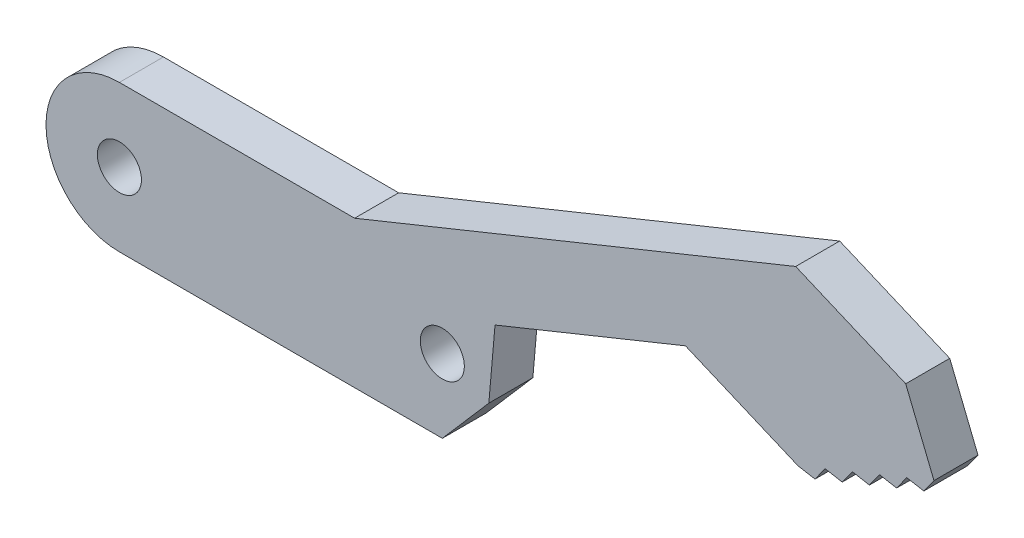
ISO-10303-21;
HEADER;
FILE_DESCRIPTION(('STEP AP214'),'2;1');
FILE_NAME('part.step','',(''),(''),'','','');
FILE_SCHEMA(('AUTOMOTIVE_DESIGN { 1 0 10303 214 1 1 1 1 }'));
ENDSEC;
DATA;
#1=APPLICATION_CONTEXT('core data for automotive mechanical design processes');
#2=APPLICATION_PROTOCOL_DEFINITION('international standard','automotive_design',2000,#1);
#3=PRODUCT_CONTEXT('',#1,'mechanical');
#4=PRODUCT('Part','Part','',(#3));
#5=PRODUCT_RELATED_PRODUCT_CATEGORY('part','',(#4));
#6=PRODUCT_DEFINITION_FORMATION('','',#4);
#7=PRODUCT_DEFINITION_CONTEXT('part definition',#1,'design');
#8=PRODUCT_DEFINITION('design','',#6,#7);
#9=PRODUCT_DEFINITION_SHAPE('','',#8);
#10=(LENGTH_UNIT() NAMED_UNIT(*) SI_UNIT(.MILLI.,.METRE.));
#11=(NAMED_UNIT(*) PLANE_ANGLE_UNIT() SI_UNIT($,.RADIAN.));
#12=(NAMED_UNIT(*) SI_UNIT($,.STERADIAN.) SOLID_ANGLE_UNIT());
#13=UNCERTAINTY_MEASURE_WITH_UNIT(LENGTH_MEASURE(1.E-05),#10,'distance_accuracy_value','');
#14=(GEOMETRIC_REPRESENTATION_CONTEXT(3) GLOBAL_UNCERTAINTY_ASSIGNED_CONTEXT((#13)) GLOBAL_UNIT_ASSIGNED_CONTEXT((#10,
#11,#12)) REPRESENTATION_CONTEXT('',''));
#15=CARTESIAN_POINT('',(0.,0.,0.));
#16=DIRECTION('',(0.,0.,1.));
#17=DIRECTION('',(1.,0.,0.));
#18=AXIS2_PLACEMENT_3D('',#15,#16,#17);
#19=CARTESIAN_POINT('',(-11.,0.,3.));
#20=DIRECTION('',(0.,0.,1.));
#21=DIRECTION('',(1.,0.,0.));
#22=AXIS2_PLACEMENT_3D('',#19,#20,#21);
#23=PLANE('',#22);
#24=CARTESIAN_POINT('',(-11.,0.,3.));
#25=DIRECTION('',(0.,0.,1.));
#26=DIRECTION('',(1.,0.,0.));
#27=AXIS2_PLACEMENT_3D('',#24,#25,#26);
#28=CIRCLE('',#27,1.5);
#29=CARTESIAN_POINT('',(-9.5,0.,3.));
#30=VERTEX_POINT('',#29);
#31=EDGE_CURVE('E502',#30,#30,#28,.T.);
#32=ORIENTED_EDGE('',*,*,#31,.F.);
#33=EDGE_LOOP('',(#32));
#34=FACE_BOUND('',#33,.T.);
#35=CARTESIAN_POINT('',(11.,0.,3.));
#36=DIRECTION('',(0.,0.,1.));
#37=DIRECTION('',(1.,0.,0.));
#38=AXIS2_PLACEMENT_3D('',#35,#36,#37);
#39=CIRCLE('',#38,1.5);
#40=CARTESIAN_POINT('',(12.5,0.,3.));
#41=VERTEX_POINT('',#40);
#42=EDGE_CURVE('E496',#41,#41,#39,.T.);
#43=ORIENTED_EDGE('',*,*,#42,.F.);
#44=EDGE_LOOP('',(#43));
#45=FACE_BOUND('',#44,.T.);
#46=DIRECTION('',(0.583953193038435,0.811787329502141,0.));
#47=VECTOR('',#46,1.);
#48=CARTESIAN_POINT('',(20.3180880668314,-22.5284343101303,3.));
#49=LINE('',#48,#47);
#50=CARTESIAN_POINT('',(41.9489676857093,7.54191072767047,3.));
#51=VERTEX_POINT('',#50);
#52=CARTESIAN_POINT('',(42.6391450253805,8.50136642743177,3.));
#53=VERTEX_POINT('',#52);
#54=EDGE_CURVE('E380',#51,#53,#49,.T.);
#55=ORIENTED_EDGE('',*,*,#54,.T.);
#56=DIRECTION('',(0.98434691523672,-0.17624173871122,0.));
#57=VECTOR('',#56,1.);
#58=CARTESIAN_POINT('',(-7.85906379305354,17.5427846370097,3.));
#59=LINE('',#58,#57);
#60=CARTESIAN_POINT('',(43.8025498040009,8.29306539266934,3.));
#61=VERTEX_POINT('',#60);
#62=EDGE_CURVE('E373',#53,#61,#59,.T.);
#63=ORIENTED_EDGE('',*,*,#62,.T.);
#64=DIRECTION('',(0.583953193038437,0.811787329502139,0.));
#65=VECTOR('',#64,1.);
#66=CARTESIAN_POINT('',(21.1835144979997,-23.1509723930179,3.));
#67=LINE('',#66,#65);
#68=CARTESIAN_POINT('',(44.4927271436721,9.25252109243066,3.));
#69=VERTEX_POINT('',#68);
#70=EDGE_CURVE('E459',#61,#69,#67,.T.);
#71=ORIENTED_EDGE('',*,*,#70,.T.);
#72=DIRECTION('',(-0.375577332499434,0.926791059145808,0.));
#73=VECTOR('',#72,1.);
#74=CARTESIAN_POINT('',(44.7293408631468,8.66864272516878,3.));
#75=LINE('',#74,#73);
#76=CARTESIAN_POINT('',(42.5675474157339,14.0031788257606,3.));
#77=VERTEX_POINT('',#76);
#78=EDGE_CURVE('E470',#69,#77,#75,.T.);
#79=ORIENTED_EDGE('',*,*,#78,.T.);
#80=DIRECTION('',(0.920913521335368,-0.389766963994759,0.));
#81=VECTOR('',#80,1.);
#82=CARTESIAN_POINT('',(35.0712178677293,17.1759214789395,3.));
#83=LINE('',#82,#81);
#84=CARTESIAN_POINT('',(35.0712178677293,17.1759214789395,3.));
#85=VERTEX_POINT('',#84);
#86=EDGE_CURVE('E462',#85,#77,#83,.T.);
#87=ORIENTED_EDGE('',*,*,#86,.F.);
#88=DIRECTION('',(-0.926791059145809,-0.375577332499434,0.));
#89=VECTOR('',#88,1.);
#90=CARTESIAN_POINT('',(40.4057539683211,19.3377149263524,3.));
#91=LINE('',#90,#89);
#92=CARTESIAN_POINT('',(5.0253812661299,5.,3.));
#93=VERTEX_POINT('',#92);
#94=EDGE_CURVE('E240',#85,#93,#91,.T.);
#95=ORIENTED_EDGE('',*,*,#94,.T.);
#96=DIRECTION('',(-1.,0.,0.));
#97=VECTOR('',#96,1.);
#98=CARTESIAN_POINT('',(11.,5.,3.));
#99=LINE('',#98,#97);
#100=CARTESIAN_POINT('',(-11.,5.,3.));
#101=VERTEX_POINT('',#100);
#102=EDGE_CURVE('E513',#93,#101,#99,.T.);
#103=ORIENTED_EDGE('',*,*,#102,.T.);
#104=CARTESIAN_POINT('',(-11.,0.,3.));
#105=DIRECTION('',(0.,0.,1.));
#106=DIRECTION('',(1.,0.,0.));
#107=AXIS2_PLACEMENT_3D('',#104,#105,#106);
#108=CIRCLE('',#107,5.);
#109=CARTESIAN_POINT('',(-11.,-5.,3.));
#110=VERTEX_POINT('',#109);
#111=EDGE_CURVE('E508',#101,#110,#108,.T.);
#112=ORIENTED_EDGE('',*,*,#111,.T.);
#113=DIRECTION('',(1.,0.,0.));
#114=VECTOR('',#113,1.);
#115=CARTESIAN_POINT('',(11.,-5.,3.));
#116=LINE('',#115,#114);
#117=CARTESIAN_POINT('',(11.,-5.,3.));
#118=VERTEX_POINT('',#117);
#119=EDGE_CURVE('E511',#110,#118,#116,.T.);
#120=ORIENTED_EDGE('',*,*,#119,.T.);
#121=DIRECTION('',(-0.654532528371202,-0.756033841374844,0.));
#122=VECTOR('',#121,1.);
#123=CARTESIAN_POINT('',(4.04916143333439,-13.0287364715239,3.));
#124=LINE('',#123,#122);
#125=CARTESIAN_POINT('',(14.1679374373166,-1.34079620774576,3.));
#126=VERTEX_POINT('',#125);
#127=EDGE_CURVE('E396',#126,#118,#124,.T.);
#128=ORIENTED_EDGE('',*,*,#127,.F.);
#129=DIRECTION('',(-0.0870824867375038,-0.996201104448099,0.));
#130=VECTOR('',#129,1.);
#131=CARTESIAN_POINT('',(14.0933962293825,-2.19352832935749,3.));
#132=LINE('',#131,#130);
#133=CARTESIAN_POINT('',(14.5894166731261,3.48081713778304,3.));
#134=VERTEX_POINT('',#133);
#135=EDGE_CURVE('E394',#134,#126,#132,.T.);
#136=ORIENTED_EDGE('',*,*,#135,.F.);
#137=DIRECTION('',(-0.926791059145808,-0.375577332499435,0.));
#138=VECTOR('',#137,1.);
#139=CARTESIAN_POINT('',(27.5644915011674,8.73889979277513,3.));
#140=LINE('',#139,#138);
#141=CARTESIAN_POINT('',(27.5644915011674,8.73889979277513,3.));
#142=VERTEX_POINT('',#141);
#143=EDGE_CURVE('E485',#142,#134,#140,.T.);
#144=ORIENTED_EDGE('',*,*,#143,.F.);
#145=DIRECTION('',(-0.920913521335371,0.389766963994754,0.));
#146=VECTOR('',#145,1.);
#147=CARTESIAN_POINT('',(35.224816552214,5.4967477674363,3.));
#148=LINE('',#147,#146);
#149=CARTESIAN_POINT('',(35.224816552214,5.4967477674363,3.));
#150=VERTEX_POINT('',#149);
#151=EDGE_CURVE('E475',#150,#142,#148,.T.);
#152=ORIENTED_EDGE('',*,*,#151,.F.);
#153=DIRECTION('',(0.98434691523672,-0.176241738711218,0.));
#154=VECTOR('',#153,1.);
#155=CARTESIAN_POINT('',(-8.61061165990349,13.3452328550301,3.));
#156=LINE('',#155,#154);
#157=CARTESIAN_POINT('',(36.3882213308345,5.28844673267387,3.));
#158=VERTEX_POINT('',#157);
#159=EDGE_CURVE('E405',#150,#158,#156,.T.);
#160=ORIENTED_EDGE('',*,*,#159,.T.);
#161=DIRECTION('',(0.583953193038435,0.81178732950214,0.));
#162=VECTOR('',#161,1.);
#163=CARTESIAN_POINT('',(17.7218087733259,-20.6608200614676,3.));
#164=LINE('',#163,#162);
#165=CARTESIAN_POINT('',(37.0783986705056,6.24790243243516,3.));
#166=VERTEX_POINT('',#165);
#167=EDGE_CURVE('E427',#158,#166,#164,.T.);
#168=ORIENTED_EDGE('',*,*,#167,.T.);
#169=DIRECTION('',(0.984346915236721,-0.176241738711215,0.));
#170=VECTOR('',#169,1.);
#171=CARTESIAN_POINT('',(-8.42272469319109,14.3946208005248,3.));
#172=LINE('',#171,#170);
#173=CARTESIAN_POINT('',(38.2418034491261,6.03960139767273,3.));
#174=VERTEX_POINT('',#173);
#175=EDGE_CURVE('E450',#166,#174,#172,.T.);
#176=ORIENTED_EDGE('',*,*,#175,.T.);
#177=DIRECTION('',(0.583953193038435,0.81178732950214,0.));
#178=VECTOR('',#177,1.);
#179=CARTESIAN_POINT('',(18.5872352044944,-21.2833581443551,3.));
#180=LINE('',#179,#178);
#181=CARTESIAN_POINT('',(38.9319807887972,6.99905709743402,3.));
#182=VERTEX_POINT('',#181);
#183=EDGE_CURVE('E421',#174,#182,#180,.T.);
#184=ORIENTED_EDGE('',*,*,#183,.T.);
#185=DIRECTION('',(0.984346915236721,-0.176241738711213,0.));
#186=VECTOR('',#185,1.);
#187=CARTESIAN_POINT('',(-8.23483772647869,15.4440087460196,3.));
#188=LINE('',#187,#186);
#189=CARTESIAN_POINT('',(40.0953855674177,6.7907560626716,3.));
#190=VERTEX_POINT('',#189);
#191=EDGE_CURVE('E417',#182,#190,#188,.T.);
#192=ORIENTED_EDGE('',*,*,#191,.T.);
#193=DIRECTION('',(0.583953193038434,0.811787329502141,0.));
#194=VECTOR('',#193,1.);
#195=CARTESIAN_POINT('',(19.4526616356629,-21.9058962272427,3.));
#196=LINE('',#195,#194);
#197=CARTESIAN_POINT('',(40.7855629070889,7.75021176243289,3.));
#198=VERTEX_POINT('',#197);
#199=EDGE_CURVE('E453',#190,#198,#196,.T.);
#200=ORIENTED_EDGE('',*,*,#199,.T.);
#201=DIRECTION('',(0.984346915236721,-0.176241738711217,0.));
#202=VECTOR('',#201,1.);
#203=CARTESIAN_POINT('',(-8.04695075976612,16.4933966915146,3.));
#204=LINE('',#203,#202);
#205=EDGE_CURVE('E456',#198,#51,#204,.T.);
#206=ORIENTED_EDGE('',*,*,#205,.T.);
#207=EDGE_LOOP('',(#55,#63,#71,#79,#87,#95,#103,#112,#120,#128,#136,#144,#152,#160,#168,#176,
#184,#192,#200,#206));
#208=FACE_BOUND('',#207,.T.);
#209=ADVANCED_FACE('F215',(#34,#45,#208),#23,.T.);
#210=CARTESIAN_POINT('',(-11.,0.,0.));
#211=DIRECTION('',(0.,0.,1.));
#212=DIRECTION('',(1.,0.,0.));
#213=AXIS2_PLACEMENT_3D('',#210,#211,#212);
#214=PLANE('',#213);
#215=CARTESIAN_POINT('',(-11.,0.,0.));
#216=DIRECTION('',(0.,0.,1.));
#217=DIRECTION('',(1.,0.,0.));
#218=AXIS2_PLACEMENT_3D('',#215,#216,#217);
#219=CIRCLE('',#218,1.5);
#220=CARTESIAN_POINT('',(-9.5,0.,0.));
#221=VERTEX_POINT('',#220);
#222=EDGE_CURVE('E499',#221,#221,#219,.T.);
#223=ORIENTED_EDGE('',*,*,#222,.T.);
#224=EDGE_LOOP('',(#223));
#225=FACE_BOUND('',#224,.T.);
#226=CARTESIAN_POINT('',(11.,0.,0.));
#227=DIRECTION('',(0.,0.,1.));
#228=DIRECTION('',(1.,0.,0.));
#229=AXIS2_PLACEMENT_3D('',#226,#227,#228);
#230=CIRCLE('',#229,1.5);
#231=CARTESIAN_POINT('',(12.5,0.,0.));
#232=VERTEX_POINT('',#231);
#233=EDGE_CURVE('E490',#232,#232,#230,.T.);
#234=ORIENTED_EDGE('',*,*,#233,.T.);
#235=EDGE_LOOP('',(#234));
#236=FACE_BOUND('',#235,.T.);
#237=DIRECTION('',(0.98434691523672,-0.17624173871122,0.));
#238=VECTOR('',#237,1.);
#239=CARTESIAN_POINT('',(2.79926355184296,15.6344715068098,0.));
#240=LINE('',#239,#238);
#241=CARTESIAN_POINT('',(42.6391450253805,8.50136642743177,0.));
#242=VERTEX_POINT('',#241);
#243=CARTESIAN_POINT('',(43.8025498040009,8.29306539266934,0.));
#244=VERTEX_POINT('',#243);
#245=EDGE_CURVE('E367',#242,#244,#240,.T.);
#246=ORIENTED_EDGE('',*,*,#245,.F.);
#247=DIRECTION('',(0.583953193038435,0.81178732950214,0.));
#248=VECTOR('',#247,1.);
#249=CARTESIAN_POINT('',(24.069102715089,-17.3139304756902,0.));
#250=LINE('',#249,#248);
#251=CARTESIAN_POINT('',(41.9489676857093,7.54191072767047,0.));
#252=VERTEX_POINT('',#251);
#253=EDGE_CURVE('E356',#252,#242,#250,.T.);
#254=ORIENTED_EDGE('',*,*,#253,.F.);
#255=DIRECTION('',(0.984346915236721,-0.176241738711217,0.));
#256=VECTOR('',#255,1.);
#257=CARTESIAN_POINT('',(2.6113765851304,14.5850835613148,0.));
#258=LINE('',#257,#256);
#259=CARTESIAN_POINT('',(40.7855629070889,7.75021176243289,0.));
#260=VERTEX_POINT('',#259);
#261=EDGE_CURVE('E430',#260,#252,#258,.T.);
#262=ORIENTED_EDGE('',*,*,#261,.F.);
#263=DIRECTION('',(0.583953193038434,0.811787329502141,0.));
#264=VECTOR('',#263,1.);
#265=CARTESIAN_POINT('',(23.2036762839205,-16.6913923928026,0.));
#266=LINE('',#265,#264);
#267=CARTESIAN_POINT('',(40.0953855674177,6.7907560626716,0.));
#268=VERTEX_POINT('',#267);
#269=EDGE_CURVE('E435',#268,#260,#266,.T.);
#270=ORIENTED_EDGE('',*,*,#269,.F.);
#271=DIRECTION('',(0.984346915236721,-0.176241738711213,0.));
#272=VECTOR('',#271,1.);
#273=CARTESIAN_POINT('',(2.42348961841785,13.5356956158198,0.));
#274=LINE('',#273,#272);
#275=CARTESIAN_POINT('',(38.9319807887972,6.99905709743402,0.));
#276=VERTEX_POINT('',#275);
#277=EDGE_CURVE('E415',#276,#268,#274,.T.);
#278=ORIENTED_EDGE('',*,*,#277,.F.);
#279=DIRECTION('',(0.583953193038435,0.81178732950214,0.));
#280=VECTOR('',#279,1.);
#281=CARTESIAN_POINT('',(22.338249852752,-16.068854309915,0.));
#282=LINE('',#281,#280);
#283=CARTESIAN_POINT('',(38.2418034491261,6.03960139767273,0.));
#284=VERTEX_POINT('',#283);
#285=EDGE_CURVE('E413',#284,#276,#282,.T.);
#286=ORIENTED_EDGE('',*,*,#285,.F.);
#287=DIRECTION('',(0.984346915236721,-0.176241738711215,0.));
#288=VECTOR('',#287,1.);
#289=CARTESIAN_POINT('',(2.23560265170544,12.4863076703251,0.));
#290=LINE('',#289,#288);
#291=CARTESIAN_POINT('',(37.0783986705056,6.24790243243516,0.));
#292=VERTEX_POINT('',#291);
#293=EDGE_CURVE('E436',#292,#284,#290,.T.);
#294=ORIENTED_EDGE('',*,*,#293,.F.);
#295=DIRECTION('',(0.583953193038435,0.81178732950214,0.));
#296=VECTOR('',#295,1.);
#297=CARTESIAN_POINT('',(21.4728234215835,-15.4463162270274,0.));
#298=LINE('',#297,#296);
#299=CARTESIAN_POINT('',(36.3882213308345,5.28844673267387,0.));
#300=VERTEX_POINT('',#299);
#301=EDGE_CURVE('E442',#300,#292,#298,.T.);
#302=ORIENTED_EDGE('',*,*,#301,.F.);
#303=DIRECTION('',(0.98434691523672,-0.176241738711218,0.));
#304=VECTOR('',#303,1.);
#305=CARTESIAN_POINT('',(2.04771568499302,11.4369197248303,0.));
#306=LINE('',#305,#304);
#307=CARTESIAN_POINT('',(35.224816552214,5.4967477674363,0.));
#308=VERTEX_POINT('',#307);
#309=EDGE_CURVE('E403',#308,#300,#306,.T.);
#310=ORIENTED_EDGE('',*,*,#309,.F.);
#311=DIRECTION('',(-0.920913521335371,0.389766963994754,0.));
#312=VECTOR('',#311,1.);
#313=CARTESIAN_POINT('',(35.224816552214,5.4967477674363,0.));
#314=LINE('',#313,#312);
#315=CARTESIAN_POINT('',(27.5644915011674,8.73889979277513,0.));
#316=VERTEX_POINT('',#315);
#317=EDGE_CURVE('E480',#308,#316,#314,.T.);
#318=ORIENTED_EDGE('',*,*,#317,.T.);
#319=DIRECTION('',(-0.926791059145808,-0.375577332499435,0.));
#320=VECTOR('',#319,1.);
#321=CARTESIAN_POINT('',(27.5644915011674,8.73889979277513,0.));
#322=LINE('',#321,#320);
#323=CARTESIAN_POINT('',(14.5894166731261,3.48081713778304,0.));
#324=VERTEX_POINT('',#323);
#325=EDGE_CURVE('E477',#316,#324,#322,.T.);
#326=ORIENTED_EDGE('',*,*,#325,.T.);
#327=DIRECTION('',(-0.0870824867375038,-0.996201104448099,0.));
#328=VECTOR('',#327,1.);
#329=CARTESIAN_POINT('',(14.5894166731261,3.48081713778304,0.));
#330=LINE('',#329,#328);
#331=CARTESIAN_POINT('',(14.1679374373166,-1.34079620774576,0.));
#332=VERTEX_POINT('',#331);
#333=EDGE_CURVE('E388',#324,#332,#330,.T.);
#334=ORIENTED_EDGE('',*,*,#333,.T.);
#335=DIRECTION('',(-0.654532528371201,-0.756033841374844,0.));
#336=VECTOR('',#335,1.);
#337=CARTESIAN_POINT('',(14.1679374373166,-1.34079620774576,0.));
#338=LINE('',#337,#336);
#339=CARTESIAN_POINT('',(11.,-5.,0.));
#340=VERTEX_POINT('',#339);
#341=EDGE_CURVE('E384',#332,#340,#338,.T.);
#342=ORIENTED_EDGE('',*,*,#341,.T.);
#343=DIRECTION('',(1.,0.,0.));
#344=VECTOR('',#343,1.);
#345=CARTESIAN_POINT('',(11.,-5.,0.));
#346=LINE('',#345,#344);
#347=CARTESIAN_POINT('',(-11.,-5.,0.));
#348=VERTEX_POINT('',#347);
#349=EDGE_CURVE('E518',#348,#340,#346,.T.);
#350=ORIENTED_EDGE('',*,*,#349,.F.);
#351=CARTESIAN_POINT('',(-11.,0.,0.));
#352=DIRECTION('',(0.,0.,1.));
#353=DIRECTION('',(1.,0.,0.));
#354=AXIS2_PLACEMENT_3D('',#351,#352,#353);
#355=CIRCLE('',#354,5.);
#356=CARTESIAN_POINT('',(-11.,5.,0.));
#357=VERTEX_POINT('',#356);
#358=EDGE_CURVE('E505',#357,#348,#355,.T.);
#359=ORIENTED_EDGE('',*,*,#358,.F.);
#360=DIRECTION('',(-1.,0.,0.));
#361=VECTOR('',#360,1.);
#362=CARTESIAN_POINT('',(11.,5.,0.));
#363=LINE('',#362,#361);
#364=CARTESIAN_POINT('',(5.0253812661299,5.,0.));
#365=VERTEX_POINT('',#364);
#366=EDGE_CURVE('E512',#365,#357,#363,.T.);
#367=ORIENTED_EDGE('',*,*,#366,.F.);
#368=DIRECTION('',(-0.926791059145809,-0.375577332499434,0.));
#369=VECTOR('',#368,1.);
#370=CARTESIAN_POINT('',(40.4057539683211,19.3377149263524,0.));
#371=LINE('',#370,#369);
#372=CARTESIAN_POINT('',(35.0712178677293,17.1759214789395,0.));
#373=VERTEX_POINT('',#372);
#374=EDGE_CURVE('E474',#373,#365,#371,.T.);
#375=ORIENTED_EDGE('',*,*,#374,.F.);
#376=DIRECTION('',(0.920913521335368,-0.389766963994759,0.));
#377=VECTOR('',#376,1.);
#378=CARTESIAN_POINT('',(35.0712178677293,17.1759214789395,0.));
#379=LINE('',#378,#377);
#380=CARTESIAN_POINT('',(42.5675474157339,14.0031788257606,0.));
#381=VERTEX_POINT('',#380);
#382=EDGE_CURVE('E232',#373,#381,#379,.T.);
#383=ORIENTED_EDGE('',*,*,#382,.T.);
#384=DIRECTION('',(-0.375577332499434,0.926791059145808,0.));
#385=VECTOR('',#384,1.);
#386=CARTESIAN_POINT('',(44.7293408631468,8.66864272516878,0.));
#387=LINE('',#386,#385);
#388=CARTESIAN_POINT('',(44.4927271436721,9.25252109243066,0.));
#389=VERTEX_POINT('',#388);
#390=EDGE_CURVE('E472',#389,#381,#387,.T.);
#391=ORIENTED_EDGE('',*,*,#390,.F.);
#392=DIRECTION('',(0.583953193038437,0.811787329502139,0.));
#393=VECTOR('',#392,1.);
#394=CARTESIAN_POINT('',(24.9345291462574,-17.9364685585778,0.));
#395=LINE('',#394,#393);
#396=EDGE_CURVE('E378',#244,#389,#395,.T.);
#397=ORIENTED_EDGE('',*,*,#396,.F.);
#398=EDGE_LOOP('',(#246,#254,#262,#270,#278,#286,#294,#302,#310,#318,#326,#334,#342,#350,#359,
#367,#375,#383,#391,#397));
#399=FACE_BOUND('',#398,.T.);
#400=ADVANCED_FACE('F376',(#225,#236,#399),#214,.F.);
#401=CARTESIAN_POINT('',(44.7293408631468,8.66864272516878,0.));
#402=DIRECTION('',(0.926791059145808,0.375577332499434,0.));
#403=DIRECTION('',(-0.375577332499434,0.926791059145809,0.));
#404=AXIS2_PLACEMENT_3D('',#401,#402,#403);
#405=PLANE('',#404);
#406=ORIENTED_EDGE('',*,*,#78,.F.);
#407=DIRECTION('',(0.,0.,1.));
#408=VECTOR('',#407,1.);
#409=CARTESIAN_POINT('',(44.4927271436721,9.25252109243066,0.));
#410=LINE('',#409,#408);
#411=EDGE_CURVE('E428',#389,#69,#410,.T.);
#412=ORIENTED_EDGE('',*,*,#411,.F.);
#413=ORIENTED_EDGE('',*,*,#390,.T.);
#414=DIRECTION('',(0.,0.,1.));
#415=VECTOR('',#414,1.);
#416=CARTESIAN_POINT('',(42.5675474157339,14.0031788257606,0.));
#417=LINE('',#416,#415);
#418=EDGE_CURVE('E467',#381,#77,#417,.T.);
#419=ORIENTED_EDGE('',*,*,#418,.T.);
#420=EDGE_LOOP('',(#406,#412,#413,#419));
#421=FACE_BOUND('',#420,.T.);
#422=ADVANCED_FACE('F580',(#421),#405,.T.);
#423=CARTESIAN_POINT('',(-11.,0.,3.));
#424=DIRECTION('',(0.,0.,-1.));
#425=DIRECTION('',(-1.,0.,0.));
#426=AXIS2_PLACEMENT_3D('',#423,#424,#425);
#427=CYLINDRICAL_SURFACE('',#426,5.);
#428=ORIENTED_EDGE('',*,*,#358,.T.);
#429=DIRECTION('',(0.,0.,-1.));
#430=VECTOR('',#429,1.);
#431=CARTESIAN_POINT('',(-11.,-5.,3.));
#432=LINE('',#431,#430);
#433=EDGE_CURVE('E12',#110,#348,#432,.T.);
#434=ORIENTED_EDGE('',*,*,#433,.F.);
#435=ORIENTED_EDGE('',*,*,#111,.F.);
#436=DIRECTION('',(0.,0.,-1.));
#437=VECTOR('',#436,1.);
#438=CARTESIAN_POINT('',(-11.,5.,3.));
#439=LINE('',#438,#437);
#440=EDGE_CURVE('E515',#101,#357,#439,.T.);
#441=ORIENTED_EDGE('',*,*,#440,.T.);
#442=EDGE_LOOP('',(#428,#434,#435,#441));
#443=FACE_BOUND('',#442,.T.);
#444=ADVANCED_FACE('F217',(#443),#427,.T.);
#445=CARTESIAN_POINT('',(11.,-5.,3.));
#446=DIRECTION('',(0.,1.,0.));
#447=DIRECTION('',(-1.,0.,0.));
#448=AXIS2_PLACEMENT_3D('',#445,#446,#447);
#449=PLANE('',#448);
#450=ORIENTED_EDGE('',*,*,#349,.T.);
#451=DIRECTION('',(0.,0.,-1.));
#452=VECTOR('',#451,1.);
#453=CARTESIAN_POINT('',(11.,-5.,3.));
#454=LINE('',#453,#452);
#455=EDGE_CURVE('E224',#118,#340,#454,.T.);
#456=ORIENTED_EDGE('',*,*,#455,.F.);
#457=ORIENTED_EDGE('',*,*,#119,.F.);
#458=ORIENTED_EDGE('',*,*,#433,.T.);
#459=EDGE_LOOP('',(#450,#456,#457,#458));
#460=FACE_BOUND('',#459,.T.);
#461=ADVANCED_FACE('F596',(#460),#449,.F.);
#462=CARTESIAN_POINT('',(11.,5.,3.));
#463=DIRECTION('',(0.,-1.,0.));
#464=DIRECTION('',(1.,0.,0.));
#465=AXIS2_PLACEMENT_3D('',#462,#463,#464);
#466=PLANE('',#465);
#467=ORIENTED_EDGE('',*,*,#102,.F.);
#468=DIRECTION('',(0.,0.,1.));
#469=VECTOR('',#468,1.);
#470=CARTESIAN_POINT('',(5.0253812661299,5.,0.));
#471=LINE('',#470,#469);
#472=EDGE_CURVE('E482',#365,#93,#471,.T.);
#473=ORIENTED_EDGE('',*,*,#472,.F.);
#474=ORIENTED_EDGE('',*,*,#366,.T.);
#475=ORIENTED_EDGE('',*,*,#440,.F.);
#476=EDGE_LOOP('',(#467,#473,#474,#475));
#477=FACE_BOUND('',#476,.T.);
#478=ADVANCED_FACE('F589',(#477),#466,.F.);
#479=CARTESIAN_POINT('',(-11.,0.,3.));
#480=DIRECTION('',(0.,0.,-1.));
#481=DIRECTION('',(-1.,0.,0.));
#482=AXIS2_PLACEMENT_3D('',#479,#480,#481);
#483=CYLINDRICAL_SURFACE('',#482,1.5);
#484=ORIENTED_EDGE('',*,*,#31,.T.);
#485=EDGE_LOOP('',(#484));
#486=FACE_BOUND('',#485,.T.);
#487=ORIENTED_EDGE('',*,*,#222,.F.);
#488=EDGE_LOOP('',(#487));
#489=FACE_BOUND('',#488,.T.);
#490=ADVANCED_FACE('F623',(#486,#489),#483,.F.);
#491=CARTESIAN_POINT('',(11.,0.,3.));
#492=DIRECTION('',(0.,0.,-1.));
#493=DIRECTION('',(-1.,0.,0.));
#494=AXIS2_PLACEMENT_3D('',#491,#492,#493);
#495=CYLINDRICAL_SURFACE('',#494,1.5);
#496=ORIENTED_EDGE('',*,*,#42,.T.);
#497=EDGE_LOOP('',(#496));
#498=FACE_BOUND('',#497,.T.);
#499=ORIENTED_EDGE('',*,*,#233,.F.);
#500=EDGE_LOOP('',(#499));
#501=FACE_BOUND('',#500,.T.);
#502=ADVANCED_FACE('F639',(#498,#501),#495,.F.);
#503=CARTESIAN_POINT('',(35.224816552214,5.4967477674363,0.));
#504=DIRECTION('',(0.389766963994754,0.920913521335371,0.));
#505=DIRECTION('',(-0.920913521335371,0.389766963994754,0.));
#506=AXIS2_PLACEMENT_3D('',#503,#504,#505);
#507=PLANE('',#506);
#508=ORIENTED_EDGE('',*,*,#151,.T.);
#509=DIRECTION('',(0.,0.,1.));
#510=VECTOR('',#509,1.);
#511=CARTESIAN_POINT('',(27.5644915011674,8.73889979277513,0.));
#512=LINE('',#511,#510);
#513=EDGE_CURVE('E491',#316,#142,#512,.T.);
#514=ORIENTED_EDGE('',*,*,#513,.F.);
#515=ORIENTED_EDGE('',*,*,#317,.F.);
#516=DIRECTION('',(0.,0.,1.));
#517=VECTOR('',#516,1.);
#518=CARTESIAN_POINT('',(35.224816552214,5.4967477674363,0.));
#519=LINE('',#518,#517);
#520=EDGE_CURVE('E487',#308,#150,#519,.T.);
#521=ORIENTED_EDGE('',*,*,#520,.T.);
#522=EDGE_LOOP('',(#508,#514,#515,#521));
#523=FACE_BOUND('',#522,.T.);
#524=ADVANCED_FACE('F547',(#523),#507,.F.);
#525=CARTESIAN_POINT('',(27.5644915011674,8.73889979277513,0.));
#526=DIRECTION('',(-0.375577332499434,0.926791059145808,0.));
#527=DIRECTION('',(-0.926791059145809,-0.375577332499435,0.));
#528=AXIS2_PLACEMENT_3D('',#525,#526,#527);
#529=PLANE('',#528);
#530=ORIENTED_EDGE('',*,*,#143,.T.);
#531=DIRECTION('',(0.,0.,1.));
#532=VECTOR('',#531,1.);
#533=CARTESIAN_POINT('',(14.5894166731261,3.48081713778304,0.));
#534=LINE('',#533,#532);
#535=EDGE_CURVE('E494',#324,#134,#534,.T.);
#536=ORIENTED_EDGE('',*,*,#535,.F.);
#537=ORIENTED_EDGE('',*,*,#325,.F.);
#538=ORIENTED_EDGE('',*,*,#513,.T.);
#539=EDGE_LOOP('',(#530,#536,#537,#538));
#540=FACE_BOUND('',#539,.T.);
#541=ADVANCED_FACE('F543',(#540),#529,.F.);
#542=CARTESIAN_POINT('',(40.4057539683211,19.3377149263524,0.));
#543=DIRECTION('',(-0.375577332499434,0.926791059145808,0.));
#544=DIRECTION('',(-0.926791059145809,-0.375577332499434,0.));
#545=AXIS2_PLACEMENT_3D('',#542,#543,#544);
#546=PLANE('',#545);
#547=DIRECTION('',(0.,0.,1.));
#548=VECTOR('',#547,1.);
#549=CARTESIAN_POINT('',(35.0712178677293,17.1759214789395,0.));
#550=LINE('',#549,#548);
#551=EDGE_CURVE('E464',#373,#85,#550,.T.);
#552=ORIENTED_EDGE('',*,*,#551,.F.);
#553=ORIENTED_EDGE('',*,*,#374,.T.);
#554=ORIENTED_EDGE('',*,*,#472,.T.);
#555=ORIENTED_EDGE('',*,*,#94,.F.);
#556=EDGE_LOOP('',(#552,#553,#554,#555));
#557=FACE_BOUND('',#556,.T.);
#558=ADVANCED_FACE('F586',(#557),#546,.T.);
#559=CARTESIAN_POINT('',(35.0712178677293,17.1759214789395,0.));
#560=DIRECTION('',(-0.389766963994759,-0.920913521335368,0.));
#561=DIRECTION('',(0.920913521335368,-0.389766963994759,0.));
#562=AXIS2_PLACEMENT_3D('',#559,#560,#561);
#563=PLANE('',#562);
#564=ORIENTED_EDGE('',*,*,#86,.T.);
#565=ORIENTED_EDGE('',*,*,#418,.F.);
#566=ORIENTED_EDGE('',*,*,#382,.F.);
#567=ORIENTED_EDGE('',*,*,#551,.T.);
#568=EDGE_LOOP('',(#564,#565,#566,#567));
#569=FACE_BOUND('',#568,.T.);
#570=ADVANCED_FACE('F672',(#569),#563,.F.);
#571=CARTESIAN_POINT('',(2.23560265170544,12.4863076703251,0.));
#572=DIRECTION('',(-0.176241738711215,-0.98434691523672,0.));
#573=DIRECTION('',(0.984346915236721,-0.176241738711215,0.));
#574=AXIS2_PLACEMENT_3D('',#571,#572,#573);
#575=PLANE('',#574);
#576=DIRECTION('',(0.,0.,1.));
#577=VECTOR('',#576,1.);
#578=CARTESIAN_POINT('',(37.0783986705056,6.24790243243516,0.));
#579=LINE('',#578,#577);
#580=EDGE_CURVE('E439',#292,#166,#579,.T.);
#581=ORIENTED_EDGE('',*,*,#580,.F.);
#582=ORIENTED_EDGE('',*,*,#293,.T.);
#583=DIRECTION('',(0.,0.,1.));
#584=VECTOR('',#583,1.);
#585=CARTESIAN_POINT('',(38.2418034491261,6.03960139767273,0.));
#586=LINE('',#585,#584);
#587=EDGE_CURVE('E424',#284,#174,#586,.T.);
#588=ORIENTED_EDGE('',*,*,#587,.T.);
#589=ORIENTED_EDGE('',*,*,#175,.F.);
#590=EDGE_LOOP('',(#581,#582,#588,#589));
#591=FACE_BOUND('',#590,.T.);
#592=ADVANCED_FACE('F557',(#591),#575,.T.);
#593=CARTESIAN_POINT('',(21.4728234215835,-15.4463162270274,0.));
#594=DIRECTION('',(0.81178732950214,-0.583953193038435,0.));
#595=DIRECTION('',(0.583953193038435,0.81178732950214,0.));
#596=AXIS2_PLACEMENT_3D('',#593,#594,#595);
#597=PLANE('',#596);
#598=DIRECTION('',(0.,0.,1.));
#599=VECTOR('',#598,1.);
#600=CARTESIAN_POINT('',(36.3882213308345,5.28844673267387,0.));
#601=LINE('',#600,#599);
#602=EDGE_CURVE('E400',#300,#158,#601,.T.);
#603=ORIENTED_EDGE('',*,*,#602,.F.);
#604=ORIENTED_EDGE('',*,*,#301,.T.);
#605=ORIENTED_EDGE('',*,*,#580,.T.);
#606=ORIENTED_EDGE('',*,*,#167,.F.);
#607=EDGE_LOOP('',(#603,#604,#605,#606));
#608=FACE_BOUND('',#607,.T.);
#609=ADVANCED_FACE('F552',(#608),#597,.T.);
#610=CARTESIAN_POINT('',(2.6113765851304,14.5850835613148,0.));
#611=DIRECTION('',(-0.176241738711216,-0.98434691523672,0.));
#612=DIRECTION('',(0.984346915236721,-0.176241738711217,0.));
#613=AXIS2_PLACEMENT_3D('',#610,#611,#612);
#614=PLANE('',#613);
#615=DIRECTION('',(0.,0.,1.));
#616=VECTOR('',#615,1.);
#617=CARTESIAN_POINT('',(40.7855629070889,7.75021176243289,0.));
#618=LINE('',#617,#616);
#619=EDGE_CURVE('E432',#260,#198,#618,.T.);
#620=ORIENTED_EDGE('',*,*,#619,.F.);
#621=ORIENTED_EDGE('',*,*,#261,.T.);
#622=DIRECTION('',(0.,0.,1.));
#623=VECTOR('',#622,1.);
#624=CARTESIAN_POINT('',(41.9489676857093,7.54191072767047,0.));
#625=LINE('',#624,#623);
#626=EDGE_CURVE('E362',#252,#51,#625,.T.);
#627=ORIENTED_EDGE('',*,*,#626,.T.);
#628=ORIENTED_EDGE('',*,*,#205,.F.);
#629=EDGE_LOOP('',(#620,#621,#627,#628));
#630=FACE_BOUND('',#629,.T.);
#631=ADVANCED_FACE('F573',(#630),#614,.T.);
#632=CARTESIAN_POINT('',(23.2036762839205,-16.6913923928026,0.));
#633=DIRECTION('',(0.811787329502141,-0.583953193038434,0.));
#634=DIRECTION('',(0.583953193038434,0.811787329502141,0.));
#635=AXIS2_PLACEMENT_3D('',#632,#633,#634);
#636=PLANE('',#635);
#637=DIRECTION('',(0.,0.,1.));
#638=VECTOR('',#637,1.);
#639=CARTESIAN_POINT('',(40.0953855674177,6.7907560626716,0.));
#640=LINE('',#639,#638);
#641=EDGE_CURVE('E409',#268,#190,#640,.T.);
#642=ORIENTED_EDGE('',*,*,#641,.F.);
#643=ORIENTED_EDGE('',*,*,#269,.T.);
#644=ORIENTED_EDGE('',*,*,#619,.T.);
#645=ORIENTED_EDGE('',*,*,#199,.F.);
#646=EDGE_LOOP('',(#642,#643,#644,#645));
#647=FACE_BOUND('',#646,.T.);
#648=ADVANCED_FACE('F570',(#647),#636,.T.);
#649=CARTESIAN_POINT('',(24.9345291462574,-17.9364685585778,0.));
#650=DIRECTION('',(0.811787329502139,-0.583953193038437,0.));
#651=DIRECTION('',(0.583953193038437,0.811787329502139,0.));
#652=AXIS2_PLACEMENT_3D('',#649,#650,#651);
#653=PLANE('',#652);
#654=DIRECTION('',(0.,0.,1.));
#655=VECTOR('',#654,1.);
#656=CARTESIAN_POINT('',(43.8025498040009,8.29306539266934,0.));
#657=LINE('',#656,#655);
#658=EDGE_CURVE('E425',#244,#61,#657,.T.);
#659=ORIENTED_EDGE('',*,*,#658,.F.);
#660=ORIENTED_EDGE('',*,*,#396,.T.);
#661=ORIENTED_EDGE('',*,*,#411,.T.);
#662=ORIENTED_EDGE('',*,*,#70,.F.);
#663=EDGE_LOOP('',(#659,#660,#661,#662));
#664=FACE_BOUND('',#663,.T.);
#665=ADVANCED_FACE('F577',(#664),#653,.T.);
#666=CARTESIAN_POINT('',(2.42348961841785,13.5356956158198,0.));
#667=DIRECTION('',(-0.176241738711213,-0.984346915236721,0.));
#668=DIRECTION('',(0.984346915236721,-0.176241738711213,0.));
#669=AXIS2_PLACEMENT_3D('',#666,#667,#668);
#670=PLANE('',#669);
#671=DIRECTION('',(0.,0.,1.));
#672=VECTOR('',#671,1.);
#673=CARTESIAN_POINT('',(38.9319807887972,6.99905709743402,0.));
#674=LINE('',#673,#672);
#675=EDGE_CURVE('E410',#276,#182,#674,.T.);
#676=ORIENTED_EDGE('',*,*,#675,.F.);
#677=ORIENTED_EDGE('',*,*,#277,.T.);
#678=ORIENTED_EDGE('',*,*,#641,.T.);
#679=ORIENTED_EDGE('',*,*,#191,.F.);
#680=EDGE_LOOP('',(#676,#677,#678,#679));
#681=FACE_BOUND('',#680,.T.);
#682=ADVANCED_FACE('F566',(#681),#670,.T.);
#683=CARTESIAN_POINT('',(22.338249852752,-16.068854309915,0.));
#684=DIRECTION('',(0.81178732950214,-0.583953193038435,0.));
#685=DIRECTION('',(0.583953193038435,0.81178732950214,0.));
#686=AXIS2_PLACEMENT_3D('',#683,#684,#685);
#687=PLANE('',#686);
#688=ORIENTED_EDGE('',*,*,#587,.F.);
#689=ORIENTED_EDGE('',*,*,#285,.T.);
#690=ORIENTED_EDGE('',*,*,#675,.T.);
#691=ORIENTED_EDGE('',*,*,#183,.F.);
#692=EDGE_LOOP('',(#688,#689,#690,#691));
#693=FACE_BOUND('',#692,.T.);
#694=ADVANCED_FACE('F564',(#693),#687,.T.);
#695=CARTESIAN_POINT('',(2.04771568499302,11.4369197248303,0.));
#696=DIRECTION('',(-0.176241738711218,-0.98434691523672,0.));
#697=DIRECTION('',(0.98434691523672,-0.176241738711218,0.));
#698=AXIS2_PLACEMENT_3D('',#695,#696,#697);
#699=PLANE('',#698);
#700=ORIENTED_EDGE('',*,*,#520,.F.);
#701=ORIENTED_EDGE('',*,*,#309,.T.);
#702=ORIENTED_EDGE('',*,*,#602,.T.);
#703=ORIENTED_EDGE('',*,*,#159,.F.);
#704=EDGE_LOOP('',(#700,#701,#702,#703));
#705=FACE_BOUND('',#704,.T.);
#706=ADVANCED_FACE('F600',(#705),#699,.T.);
#707=CARTESIAN_POINT('',(2.79926355184296,15.6344715068098,0.));
#708=DIRECTION('',(-0.17624173871122,-0.98434691523672,0.));
#709=DIRECTION('',(0.98434691523672,-0.17624173871122,0.));
#710=AXIS2_PLACEMENT_3D('',#707,#708,#709);
#711=PLANE('',#710);
#712=DIRECTION('',(0.,0.,1.));
#713=VECTOR('',#712,1.);
#714=CARTESIAN_POINT('',(42.6391450253805,8.50136642743177,0.));
#715=LINE('',#714,#713);
#716=EDGE_CURVE('E359',#242,#53,#715,.T.);
#717=ORIENTED_EDGE('',*,*,#716,.F.);
#718=ORIENTED_EDGE('',*,*,#245,.T.);
#719=ORIENTED_EDGE('',*,*,#658,.T.);
#720=ORIENTED_EDGE('',*,*,#62,.F.);
#721=EDGE_LOOP('',(#717,#718,#719,#720));
#722=FACE_BOUND('',#721,.T.);
#723=ADVANCED_FACE('F370',(#722),#711,.T.);
#724=CARTESIAN_POINT('',(24.069102715089,-17.3139304756902,0.));
#725=DIRECTION('',(0.81178732950214,-0.583953193038435,0.));
#726=DIRECTION('',(0.583953193038435,0.811787329502141,0.));
#727=AXIS2_PLACEMENT_3D('',#724,#725,#726);
#728=PLANE('',#727);
#729=ORIENTED_EDGE('',*,*,#626,.F.);
#730=ORIENTED_EDGE('',*,*,#253,.T.);
#731=ORIENTED_EDGE('',*,*,#716,.T.);
#732=ORIENTED_EDGE('',*,*,#54,.F.);
#733=EDGE_LOOP('',(#729,#730,#731,#732));
#734=FACE_BOUND('',#733,.T.);
#735=ADVANCED_FACE('F358',(#734),#728,.T.);
#736=CARTESIAN_POINT('',(14.1679374373166,-1.34079620774576,0.));
#737=DIRECTION('',(-0.756033841374844,0.654532528371202,0.));
#738=DIRECTION('',(-0.654532528371202,-0.756033841374844,0.));
#739=AXIS2_PLACEMENT_3D('',#736,#737,#738);
#740=PLANE('',#739);
#741=ORIENTED_EDGE('',*,*,#127,.T.);
#742=ORIENTED_EDGE('',*,*,#455,.T.);
#743=ORIENTED_EDGE('',*,*,#341,.F.);
#744=DIRECTION('',(0.,0.,1.));
#745=VECTOR('',#744,1.);
#746=CARTESIAN_POINT('',(14.1679374373166,-1.34079620774576,0.));
#747=LINE('',#746,#745);
#748=EDGE_CURVE('E385',#332,#126,#747,.T.);
#749=ORIENTED_EDGE('',*,*,#748,.T.);
#750=EDGE_LOOP('',(#741,#742,#743,#749));
#751=FACE_BOUND('',#750,.T.);
#752=ADVANCED_FACE('F599',(#751),#740,.F.);
#753=CARTESIAN_POINT('',(14.5894166731261,3.48081713778304,0.));
#754=DIRECTION('',(-0.996201104448099,0.0870824867375038,0.));
#755=DIRECTION('',(-0.0870824867375038,-0.996201104448099,0.));
#756=AXIS2_PLACEMENT_3D('',#753,#754,#755);
#757=PLANE('',#756);
#758=ORIENTED_EDGE('',*,*,#135,.T.);
#759=ORIENTED_EDGE('',*,*,#748,.F.);
#760=ORIENTED_EDGE('',*,*,#333,.F.);
#761=ORIENTED_EDGE('',*,*,#535,.T.);
#762=EDGE_LOOP('',(#758,#759,#760,#761));
#763=FACE_BOUND('',#762,.T.);
#764=ADVANCED_FACE('F537',(#763),#757,.F.);
#765=CLOSED_SHELL('',(#209,#400,#422,#444,#461,#478,#490,#502,#524,#541,#558,#570,#592,#609,
#631,#648,#665,#682,#694,#706,#723,#735,#752,#764));
#766=MANIFOLD_SOLID_BREP('B2',#765);
#767=ADVANCED_BREP_SHAPE_REPRESENTATION('',(#18,#766),#14);
#768=SHAPE_DEFINITION_REPRESENTATION(#9,#767);
ENDSEC;
END-ISO-10303-21;
